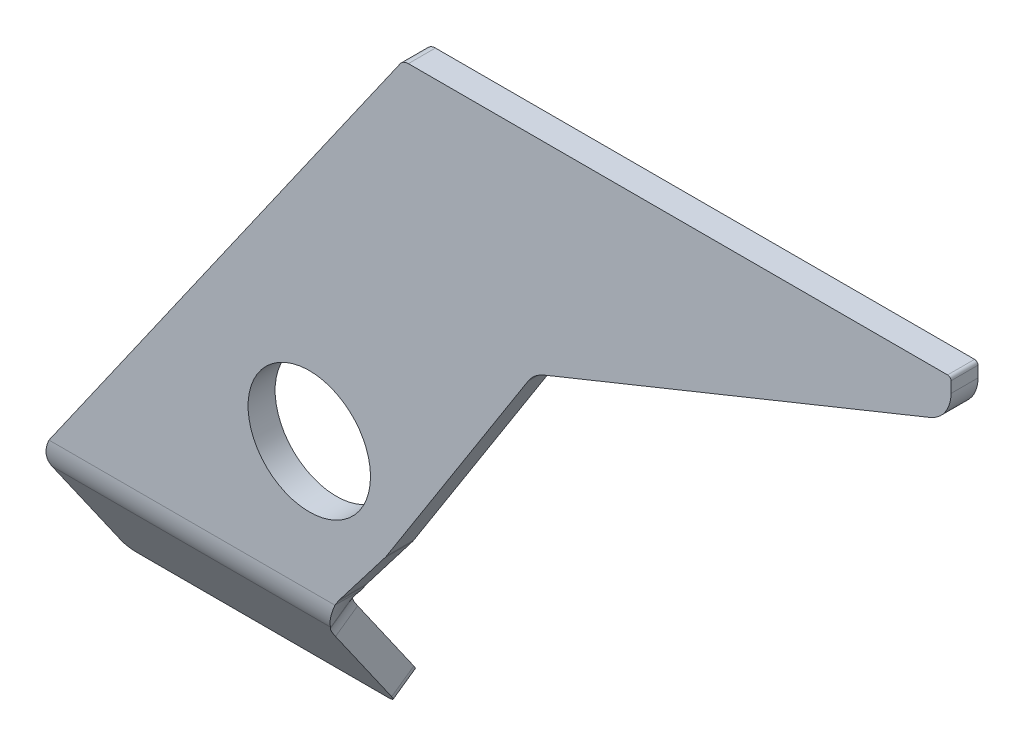
ISO-10303-21;
HEADER;
FILE_DESCRIPTION(('STEP AP214'),'2;1');
FILE_NAME('part.step','',(''),(''),'','','');
FILE_SCHEMA(('AUTOMOTIVE_DESIGN { 1 0 10303 214 1 1 1 1 }'));
ENDSEC;
DATA;
#1=APPLICATION_CONTEXT('core data for automotive mechanical design processes');
#2=APPLICATION_PROTOCOL_DEFINITION('international standard','automotive_design',2000,#1);
#3=PRODUCT_CONTEXT('',#1,'mechanical');
#4=PRODUCT('Part','Part','',(#3));
#5=PRODUCT_RELATED_PRODUCT_CATEGORY('part','',(#4));
#6=PRODUCT_DEFINITION_FORMATION('','',#4);
#7=PRODUCT_DEFINITION_CONTEXT('part definition',#1,'design');
#8=PRODUCT_DEFINITION('design','',#6,#7);
#9=PRODUCT_DEFINITION_SHAPE('','',#8);
#10=(LENGTH_UNIT() NAMED_UNIT(*) SI_UNIT(.MILLI.,.METRE.));
#11=(NAMED_UNIT(*) PLANE_ANGLE_UNIT() SI_UNIT($,.RADIAN.));
#12=(NAMED_UNIT(*) SI_UNIT($,.STERADIAN.) SOLID_ANGLE_UNIT());
#13=UNCERTAINTY_MEASURE_WITH_UNIT(LENGTH_MEASURE(1.E-05),#10,'distance_accuracy_value','');
#14=(GEOMETRIC_REPRESENTATION_CONTEXT(3) GLOBAL_UNCERTAINTY_ASSIGNED_CONTEXT((#13)) GLOBAL_UNIT_ASSIGNED_CONTEXT((#10,
#11,#12)) REPRESENTATION_CONTEXT('',''));
#15=CARTESIAN_POINT('',(0.,0.,0.));
#16=DIRECTION('',(0.,0.,1.));
#17=DIRECTION('',(1.,0.,0.));
#18=AXIS2_PLACEMENT_3D('',#15,#16,#17);
#19=CARTESIAN_POINT('',(-189.,-164.449110298945,1.234970688372));
#20=DIRECTION('',(-1.,0.,0.));
#21=DIRECTION('',(0.,-0.573576436351047,0.819152044288991));
#22=AXIS2_PLACEMENT_3D('',#19,#20,#21);
#23=PLANE('',#22);
#24=DIRECTION('',(0.,0.819152044288991,0.573576436351047));
#25=VECTOR('',#24,1.);
#26=CARTESIAN_POINT('',(-189.,-159.860498808137,-5.31824566593993));
#27=LINE('',#26,#25);
#28=CARTESIAN_POINT('',(-189.,-183.610320243859,-21.9480496663669));
#29=VERTEX_POINT('',#28);
#30=CARTESIAN_POINT('',(-189.,-159.860498808137,-5.31824566593993));
#31=VERTEX_POINT('',#30);
#32=EDGE_CURVE('E97',#29,#31,#27,.T.);
#33=ORIENTED_EDGE('',*,*,#32,.T.);
#34=DIRECTION('',(0.,0.573576436351047,-0.819152044288991));
#35=VECTOR('',#34,1.);
#36=CARTESIAN_POINT('',(-189.,-164.449110298945,1.234970688372));
#37=LINE('',#36,#35);
#38=CARTESIAN_POINT('',(-189.,-164.449110298945,1.234970688372));
#39=VERTEX_POINT('',#38);
#40=EDGE_CURVE('E284',#39,#31,#37,.T.);
#41=ORIENTED_EDGE('',*,*,#40,.F.);
#42=DIRECTION('',(0.,0.819152044288991,0.573576436351047));
#43=VECTOR('',#42,1.);
#44=CARTESIAN_POINT('',(-189.,-164.449110298945,1.234970688372));
#45=LINE('',#44,#43);
#46=CARTESIAN_POINT('',(-189.,-188.198931734667,-15.394833312055));
#47=VERTEX_POINT('',#46);
#48=EDGE_CURVE('E294',#47,#39,#45,.T.);
#49=ORIENTED_EDGE('',*,*,#48,.F.);
#50=DIRECTION('',(0.,0.573576436351047,-0.819152044288991));
#51=VECTOR('',#50,1.);
#52=CARTESIAN_POINT('',(-189.,-188.198931734667,-15.394833312055));
#53=LINE('',#52,#51);
#54=EDGE_CURVE('E264',#47,#29,#53,.T.);
#55=ORIENTED_EDGE('',*,*,#54,.T.);
#56=EDGE_LOOP('',(#33,#41,#49,#55));
#57=FACE_BOUND('',#56,.T.);
#58=ADVANCED_FACE('F39',(#57),#23,.F.);
#59=CARTESIAN_POINT('',(-192.,-188.198931734667,-15.394833312055));
#60=DIRECTION('',(0.,0.573576436351047,-0.819152044288991));
#61=DIRECTION('',(-1.,0.,0.));
#62=AXIS2_PLACEMENT_3D('',#59,#60,#61);
#63=CYLINDRICAL_SURFACE('',#62,3.00000000000002);
#64=CARTESIAN_POINT('',(-192.,-183.610320243859,-21.9480496663669));
#65=DIRECTION('',(0.,-0.573576436351047,0.819152044288991));
#66=DIRECTION('',(-1.,0.,0.));
#67=AXIS2_PLACEMENT_3D('',#64,#65,#66);
#68=CIRCLE('',#67,3.00000000000002);
#69=CARTESIAN_POINT('',(-192.,-186.067776376726,-23.6687789754201));
#70=VERTEX_POINT('',#69);
#71=EDGE_CURVE('E266',#70,#29,#68,.T.);
#72=ORIENTED_EDGE('',*,*,#71,.T.);
#73=ORIENTED_EDGE('',*,*,#54,.F.);
#74=CARTESIAN_POINT('',(-192.,-188.198931734667,-15.394833312055));
#75=DIRECTION('',(0.,-0.573576436351047,0.819152044288991));
#76=DIRECTION('',(-1.,0.,0.));
#77=AXIS2_PLACEMENT_3D('',#74,#75,#76);
#78=CIRCLE('',#77,3.00000000000002);
#79=CARTESIAN_POINT('',(-192.,-190.656387867534,-17.1155626211081));
#80=VERTEX_POINT('',#79);
#81=EDGE_CURVE('E292',#80,#47,#78,.T.);
#82=ORIENTED_EDGE('',*,*,#81,.F.);
#83=DIRECTION('',(0.,0.573576436351047,-0.819152044288991));
#84=VECTOR('',#83,1.);
#85=CARTESIAN_POINT('',(-192.,-190.656387867534,-17.1155626211081));
#86=LINE('',#85,#84);
#87=EDGE_CURVE('E268',#80,#70,#86,.T.);
#88=ORIENTED_EDGE('',*,*,#87,.T.);
#89=EDGE_LOOP('',(#72,#73,#82,#88));
#90=FACE_BOUND('',#89,.T.);
#91=ADVANCED_FACE('F647',(#90),#63,.T.);
#92=CARTESIAN_POINT('',(-192.,-190.656387867534,-17.1155626211081));
#93=DIRECTION('',(0.,0.819152044288991,0.573576436351047));
#94=DIRECTION('',(-1.,0.,0.));
#95=AXIS2_PLACEMENT_3D('',#92,#93,#94);
#96=PLANE('',#95);
#97=DIRECTION('',(1.,0.,0.));
#98=VECTOR('',#97,1.);
#99=CARTESIAN_POINT('',(-192.,-186.067776376726,-23.6687789754201));
#100=LINE('',#99,#98);
#101=CARTESIAN_POINT('',(-266.,-186.067776376726,-23.6687789754201));
#102=VERTEX_POINT('',#101);
#103=EDGE_CURVE('E271',#102,#70,#100,.T.);
#104=ORIENTED_EDGE('',*,*,#103,.T.);
#105=ORIENTED_EDGE('',*,*,#87,.F.);
#106=DIRECTION('',(1.,0.,0.));
#107=VECTOR('',#106,1.);
#108=CARTESIAN_POINT('',(-192.,-190.656387867534,-17.1155626211081));
#109=LINE('',#108,#107);
#110=CARTESIAN_POINT('',(-266.,-190.656387867534,-17.1155626211081));
#111=VERTEX_POINT('',#110);
#112=EDGE_CURVE('E290',#111,#80,#109,.T.);
#113=ORIENTED_EDGE('',*,*,#112,.F.);
#114=DIRECTION('',(0.,0.573576436351047,-0.819152044288991));
#115=VECTOR('',#114,1.);
#116=CARTESIAN_POINT('',(-266.,-190.656387867534,-17.1155626211081));
#117=LINE('',#116,#115);
#118=EDGE_CURVE('E273',#111,#102,#117,.T.);
#119=ORIENTED_EDGE('',*,*,#118,.T.);
#120=EDGE_LOOP('',(#104,#105,#113,#119));
#121=FACE_BOUND('',#120,.T.);
#122=ADVANCED_FACE('F652',(#121),#96,.F.);
#123=CARTESIAN_POINT('',(-266.,-188.198931734667,-15.394833312055));
#124=DIRECTION('',(0.,0.573576436351047,-0.819152044288991));
#125=DIRECTION('',(-1.,0.,0.));
#126=AXIS2_PLACEMENT_3D('',#123,#124,#125);
#127=CYLINDRICAL_SURFACE('',#126,2.99999999999999);
#128=CARTESIAN_POINT('',(-266.,-183.610320243859,-21.9480496663669));
#129=DIRECTION('',(0.,-0.573576436351047,0.819152044288991));
#130=DIRECTION('',(-1.,0.,0.));
#131=AXIS2_PLACEMENT_3D('',#128,#129,#130);
#132=CIRCLE('',#131,2.99999999999999);
#133=CARTESIAN_POINT('',(-269.,-183.610320243859,-21.9480496663669));
#134=VERTEX_POINT('',#133);
#135=EDGE_CURVE('E276',#134,#102,#132,.T.);
#136=ORIENTED_EDGE('',*,*,#135,.T.);
#137=ORIENTED_EDGE('',*,*,#118,.F.);
#138=CARTESIAN_POINT('',(-266.,-188.198931734667,-15.394833312055));
#139=DIRECTION('',(0.,-0.573576436351047,0.819152044288991));
#140=DIRECTION('',(-1.,0.,0.));
#141=AXIS2_PLACEMENT_3D('',#138,#139,#140);
#142=CIRCLE('',#141,2.99999999999999);
#143=CARTESIAN_POINT('',(-269.,-188.198931734667,-15.394833312055));
#144=VERTEX_POINT('',#143);
#145=EDGE_CURVE('E288',#144,#111,#142,.T.);
#146=ORIENTED_EDGE('',*,*,#145,.F.);
#147=DIRECTION('',(0.,0.573576436351047,-0.819152044288991));
#148=VECTOR('',#147,1.);
#149=CARTESIAN_POINT('',(-269.,-188.198931734667,-15.394833312055));
#150=LINE('',#149,#148);
#151=EDGE_CURVE('E278',#144,#134,#150,.T.);
#152=ORIENTED_EDGE('',*,*,#151,.T.);
#153=EDGE_LOOP('',(#136,#137,#146,#152));
#154=FACE_BOUND('',#153,.T.);
#155=ADVANCED_FACE('F657',(#154),#127,.T.);
#156=CARTESIAN_POINT('',(-179.,-164.449110298945,1.234970688372));
#157=DIRECTION('',(0.,0.573576436351047,-0.819152044288991));
#158=DIRECTION('',(-1.,0.,0.));
#159=AXIS2_PLACEMENT_3D('',#156,#157,#158);
#160=CYLINDRICAL_SURFACE('',#159,10.);
#161=CARTESIAN_POINT('',(-179.,-159.860498808137,-5.31824566593993));
#162=DIRECTION('',(0.,0.573576436351047,-0.819152044288991));
#163=DIRECTION('',(1.,0.,0.));
#164=AXIS2_PLACEMENT_3D('',#161,#162,#163);
#165=CIRCLE('',#164,10.);
#166=CARTESIAN_POINT('',(-187.433914458129,-155.459198082407,-2.23642171985605));
#167=VERTEX_POINT('',#166);
#168=EDGE_CURVE('E281',#31,#167,#165,.T.);
#169=ORIENTED_EDGE('',*,*,#168,.T.);
#170=DIRECTION('',(0.,0.573576436351047,-0.819152044288991));
#171=VECTOR('',#170,1.);
#172=CARTESIAN_POINT('',(-187.433914458129,-160.047809573216,4.31679463445588));
#173=LINE('',#172,#171);
#174=CARTESIAN_POINT('',(-187.433914458129,-160.047809573216,4.31679463445588));
#175=VERTEX_POINT('',#174);
#176=EDGE_CURVE('E256',#175,#167,#173,.T.);
#177=ORIENTED_EDGE('',*,*,#176,.F.);
#178=CARTESIAN_POINT('',(-179.,-164.449110298945,1.234970688372));
#179=DIRECTION('',(0.,0.573576436351047,-0.819152044288991));
#180=DIRECTION('',(1.,0.,0.));
#181=AXIS2_PLACEMENT_3D('',#178,#179,#180);
#182=CIRCLE('',#181,10.);
#183=EDGE_CURVE('E49',#39,#175,#182,.T.);
#184=ORIENTED_EDGE('',*,*,#183,.F.);
#185=ORIENTED_EDGE('',*,*,#40,.T.);
#186=EDGE_LOOP('',(#169,#177,#184,#185));
#187=FACE_BOUND('',#186,.T.);
#188=ADVANCED_FACE('F636',(#187),#160,.F.);
#189=CARTESIAN_POINT('',(-181.531080860369,-152.457880320241,9.63132031186721));
#190=DIRECTION('',(-0.843391445812885,0.440130072572976,0.308182394608385));
#191=DIRECTION('',(-0.537299608346825,-0.690865826973473,-0.483749459938312));
#192=AXIS2_PLACEMENT_3D('',#189,#190,#191);
#193=PLANE('',#192);
#194=CARTESIAN_POINT('',(-186.55686494568,-158.920089531545,5.10643270862383));
#195=CARTESIAN_POINT('',(-186.55686494568,-154.331478040737,-1.44678364568809));
#196=B_SPLINE_CURVE_WITH_KNOTS('',1,(#194,#195),.UNSPECIFIED.,.F.,.F.,(2,2),(0.,1.),.UNSPECIFIED.);
#197=CARTESIAN_POINT('',(-186.55686494568,-158.920089531545,5.10643270862384));
#198=VERTEX_POINT('',#197);
#199=CARTESIAN_POINT('',(-186.55686494568,-154.331478040737,-1.44678364568809));
#200=VERTEX_POINT('',#199);
#201=EDGE_CURVE('E237',#198,#200,#196,.T.);
#202=ORIENTED_EDGE('',*,*,#201,.F.);
#203=DIRECTION('',(0.537299608346825,0.690865826973473,0.483749459938312));
#204=VECTOR('',#203,1.);
#205=CARTESIAN_POINT('',(-181.531080860369,-152.457880320241,9.63132031186721));
#206=LINE('',#205,#204);
#207=EDGE_CURVE('E230',#175,#198,#206,.T.);
#208=ORIENTED_EDGE('',*,*,#207,.F.);
#209=ORIENTED_EDGE('',*,*,#176,.T.);
#210=DIRECTION('',(0.537299608346825,0.690865826973473,0.483749459938312));
#211=VECTOR('',#210,1.);
#212=CARTESIAN_POINT('',(-181.531080860369,-147.869268829433,3.07810395755528));
#213=LINE('',#212,#211);
#214=EDGE_CURVE('E58',#167,#200,#213,.T.);
#215=ORIENTED_EDGE('',*,*,#214,.T.);
#216=EDGE_LOOP('',(#202,#208,#209,#215));
#217=FACE_BOUND('',#216,.T.);
#218=ADVANCED_FACE('F246',(#217),#193,.F.);
#219=CARTESIAN_POINT('',(-179.,-164.449110298945,1.234970688372));
#220=DIRECTION('',(0.,-0.573576436351047,0.819152044288991));
#221=DIRECTION('',(1.,0.,0.));
#222=AXIS2_PLACEMENT_3D('',#219,#220,#221);
#223=PLANE('',#222);
#224=ORIENTED_EDGE('',*,*,#207,.T.);
#225=DIRECTION('',(-1.,0.,0.));
#226=VECTOR('',#225,1.);
#227=CARTESIAN_POINT('',(-179.,-158.920089531545,5.10643270862386));
#228=LINE('',#227,#226);
#229=CARTESIAN_POINT('',(-269.,-158.920089531545,5.10643270862386));
#230=VERTEX_POINT('',#229);
#231=EDGE_CURVE('E220',#198,#230,#228,.T.);
#232=ORIENTED_EDGE('',*,*,#231,.T.);
#233=DIRECTION('',(0.,-0.819152044288991,-0.573576436351047));
#234=VECTOR('',#233,1.);
#235=CARTESIAN_POINT('',(-269.,-188.198931734667,-15.394833312055));
#236=LINE('',#235,#234);
#237=EDGE_CURVE('E229',#230,#144,#236,.T.);
#238=ORIENTED_EDGE('',*,*,#237,.T.);
#239=ORIENTED_EDGE('',*,*,#145,.T.);
#240=ORIENTED_EDGE('',*,*,#112,.T.);
#241=ORIENTED_EDGE('',*,*,#81,.T.);
#242=ORIENTED_EDGE('',*,*,#48,.T.);
#243=ORIENTED_EDGE('',*,*,#183,.T.);
#244=EDGE_LOOP('',(#224,#232,#238,#239,#240,#241,#242,#243));
#245=FACE_BOUND('',#244,.T.);
#246=ADVANCED_FACE('F252',(#245),#223,.T.);
#247=CARTESIAN_POINT('',(-269.,-188.198931734667,-15.394833312055));
#248=DIRECTION('',(1.,0.,0.));
#249=DIRECTION('',(0.,0.819152044288991,0.573576436351047));
#250=AXIS2_PLACEMENT_3D('',#247,#248,#249);
#251=PLANE('',#250);
#252=DIRECTION('',(0.,-0.573576436351047,0.819152044288991));
#253=VECTOR('',#252,1.);
#254=CARTESIAN_POINT('',(-269.,-158.920089531545,5.10643270862386));
#255=LINE('',#254,#253);
#256=CARTESIAN_POINT('',(-269.,-154.331478040737,-1.44678364568808));
#257=VERTEX_POINT('',#256);
#258=EDGE_CURVE('E261',#257,#230,#255,.T.);
#259=ORIENTED_EDGE('',*,*,#258,.F.);
#260=DIRECTION('',(0.,-0.819152044288991,-0.573576436351047));
#261=VECTOR('',#260,1.);
#262=CARTESIAN_POINT('',(-269.,-183.610320243859,-21.9480496663669));
#263=LINE('',#262,#261);
#264=EDGE_CURVE('E11',#257,#134,#263,.T.);
#265=ORIENTED_EDGE('',*,*,#264,.T.);
#266=ORIENTED_EDGE('',*,*,#151,.F.);
#267=ORIENTED_EDGE('',*,*,#237,.F.);
#268=EDGE_LOOP('',(#259,#265,#266,#267));
#269=FACE_BOUND('',#268,.T.);
#270=ADVANCED_FACE('F639',(#269),#251,.F.);
#271=CARTESIAN_POINT('',(-179.,-159.860498808137,-5.31824566593993));
#272=DIRECTION('',(0.,-0.573576436351047,0.819152044288991));
#273=DIRECTION('',(1.,0.,0.));
#274=AXIS2_PLACEMENT_3D('',#271,#272,#273);
#275=PLANE('',#274);
#276=DIRECTION('',(-1.,0.,0.));
#277=VECTOR('',#276,1.);
#278=CARTESIAN_POINT('',(-179.,-154.331478040737,-1.44678364568807));
#279=LINE('',#278,#277);
#280=EDGE_CURVE('E248',#200,#257,#279,.T.);
#281=ORIENTED_EDGE('',*,*,#280,.F.);
#282=ORIENTED_EDGE('',*,*,#214,.F.);
#283=ORIENTED_EDGE('',*,*,#168,.F.);
#284=ORIENTED_EDGE('',*,*,#32,.F.);
#285=ORIENTED_EDGE('',*,*,#71,.F.);
#286=ORIENTED_EDGE('',*,*,#103,.F.);
#287=ORIENTED_EDGE('',*,*,#135,.F.);
#288=ORIENTED_EDGE('',*,*,#264,.F.);
#289=EDGE_LOOP('',(#281,#282,#283,#284,#285,#286,#287,#288));
#290=FACE_BOUND('',#289,.T.);
#291=ADVANCED_FACE('F41',(#290),#275,.F.);
#292=CARTESIAN_POINT('',(-267.19152044289,-149.917223525279,8.));
#293=DIRECTION('',(0.819152044288994,-0.573576436351042,0.));
#294=DIRECTION('',(0.573576436351042,0.819152044288994,0.));
#295=AXIS2_PLACEMENT_3D('',#292,#293,#294);
#296=PLANE('',#295);
#297=DIRECTION('',(-0.573576436351043,-0.819152044288994,0.));
#298=VECTOR('',#297,1.);
#299=CARTESIAN_POINT('',(-267.19152044289,-149.917223525279,0.));
#300=LINE('',#299,#298);
#301=CARTESIAN_POINT('',(-163.114105404232,-1.27927069094687,0.));
#302=VERTEX_POINT('',#301);
#303=CARTESIAN_POINT('',(-267.06943437441,-149.742866549928,0.));
#304=VERTEX_POINT('',#303);
#305=EDGE_CURVE('E387',#302,#304,#300,.T.);
#306=ORIENTED_EDGE('',*,*,#305,.T.);
#307=CARTESIAN_POINT('',(-267.06943437441,-149.742866549928,7.99999999999999));
#308=CARTESIAN_POINT('',(-267.06943437441,-149.742866549928,0.));
#309=B_SPLINE_CURVE_WITH_KNOTS('',1,(#307,#308),.UNSPECIFIED.,.F.,.F.,(2,2),(0.,1.),.UNSPECIFIED.);
#310=CARTESIAN_POINT('',(-267.069434374409,-149.742866549928,7.99999999999999));
#311=VERTEX_POINT('',#310);
#312=EDGE_CURVE('E249',#304,#311,#309,.F.);
#313=ORIENTED_EDGE('',*,*,#312,.T.);
#314=DIRECTION('',(-0.573576436351043,-0.819152044288994,0.));
#315=VECTOR('',#314,1.);
#316=CARTESIAN_POINT('',(-267.19152044289,-149.917223525279,8.));
#317=LINE('',#316,#315);
#318=CARTESIAN_POINT('',(-163.114105404232,-1.27927069094687,8.));
#319=VERTEX_POINT('',#318);
#320=EDGE_CURVE('E407',#319,#311,#317,.T.);
#321=ORIENTED_EDGE('',*,*,#320,.F.);
#322=DIRECTION('',(0.,0.,-1.));
#323=VECTOR('',#322,1.);
#324=CARTESIAN_POINT('',(-163.114105404232,-1.27927069094687,8.));
#325=LINE('',#324,#323);
#326=EDGE_CURVE('E404',#319,#302,#325,.T.);
#327=ORIENTED_EDGE('',*,*,#326,.T.);
#328=EDGE_LOOP('',(#306,#313,#321,#327));
#329=FACE_BOUND('',#328,.T.);
#330=ADVANCED_FACE('F303',(#329),#296,.F.);
#331=CARTESIAN_POINT('',(-179.,-163.006821503649,0.));
#332=DIRECTION('',(0.,0.,1.));
#333=DIRECTION('',(1.,0.,0.));
#334=AXIS2_PLACEMENT_3D('',#331,#332,#333);
#335=PLANE('',#334);
#336=CARTESIAN_POINT('',(-190.,-111.5,0.));
#337=DIRECTION('',(0.,0.,1.));
#338=DIRECTION('',(1.,0.,0.));
#339=AXIS2_PLACEMENT_3D('',#336,#337,#338);
#340=CIRCLE('',#339,18.1250000000005);
#341=CARTESIAN_POINT('',(-171.874999999999,-111.5,0.));
#342=VERTEX_POINT('',#341);
#343=EDGE_CURVE('E576',#342,#342,#340,.T.);
#344=ORIENTED_EDGE('',*,*,#343,.T.);
#345=EDGE_LOOP('',(#344));
#346=FACE_BOUND('',#345,.T.);
#347=DIRECTION('',(0.537299608346825,0.843391445812885,0.));
#348=VECTOR('',#347,1.);
#349=CARTESIAN_POINT('',(-181.531080860369,-148.368232657652,0.));
#350=LINE('',#349,#348);
#351=CARTESIAN_POINT('',(-182.406819232636,-149.742866549928,0.));
#352=VERTEX_POINT('',#351);
#353=CARTESIAN_POINT('',(-181.531080860369,-148.368232657652,0.));
#354=VERTEX_POINT('',#353);
#355=EDGE_CURVE('E381',#352,#354,#350,.T.);
#356=ORIENTED_EDGE('',*,*,#355,.F.);
#357=DIRECTION('',(-1.,0.,0.));
#358=VECTOR('',#357,1.);
#359=CARTESIAN_POINT('',(-179.,-149.742866549928,0.));
#360=LINE('',#359,#358);
#361=EDGE_CURVE('E112',#352,#304,#360,.T.);
#362=ORIENTED_EDGE('',*,*,#361,.T.);
#363=ORIENTED_EDGE('',*,*,#305,.F.);
#364=CARTESIAN_POINT('',(-160.656649271365,-3.,0.));
#365=DIRECTION('',(0.,0.,1.));
#366=DIRECTION('',(-1.,0.,0.));
#367=AXIS2_PLACEMENT_3D('',#364,#365,#366);
#368=CIRCLE('',#367,2.99999999999999);
#369=CARTESIAN_POINT('',(-160.656649271365,0.,0.));
#370=VERTEX_POINT('',#369);
#371=EDGE_CURVE('E389',#370,#302,#368,.T.);
#372=ORIENTED_EDGE('',*,*,#371,.F.);
#373=DIRECTION('',(-1.,0.,0.));
#374=VECTOR('',#373,1.);
#375=CARTESIAN_POINT('',(-160.656649271365,0.,0.));
#376=LINE('',#375,#374);
#377=CARTESIAN_POINT('',(-1.00000000000001,0.,0.));
#378=VERTEX_POINT('',#377);
#379=EDGE_CURVE('E395',#378,#370,#376,.T.);
#380=ORIENTED_EDGE('',*,*,#379,.F.);
#381=CARTESIAN_POINT('',(-1.,-1.,0.));
#382=DIRECTION('',(0.,0.,1.));
#383=DIRECTION('',(1.,0.,0.));
#384=AXIS2_PLACEMENT_3D('',#381,#382,#383);
#385=CIRCLE('',#384,1.);
#386=CARTESIAN_POINT('',(0.,-1.00000000000001,0.));
#387=VERTEX_POINT('',#386);
#388=EDGE_CURVE('E400',#387,#378,#385,.T.);
#389=ORIENTED_EDGE('',*,*,#388,.F.);
#390=DIRECTION('',(0.,1.,0.));
#391=VECTOR('',#390,1.);
#392=CARTESIAN_POINT('',(0.,-1.00000000000001,0.));
#393=LINE('',#392,#391);
#394=CARTESIAN_POINT('',(0.,-4.26011580755495,0.));
#395=VERTEX_POINT('',#394);
#396=EDGE_CURVE('E845',#395,#387,#393,.T.);
#397=ORIENTED_EDGE('',*,*,#396,.F.);
#398=CARTESIAN_POINT('',(-10.,-4.26011580755496,0.));
#399=DIRECTION('',(0.,0.,1.));
#400=DIRECTION('',(-1.,0.,0.));
#401=AXIS2_PLACEMENT_3D('',#398,#399,#400);
#402=CIRCLE('',#401,10.);
#403=CARTESIAN_POINT('',(-6.24730471414338,-13.5292731636208,0.));
#404=VERTEX_POINT('',#403);
#405=EDGE_CURVE('E843',#404,#395,#402,.T.);
#406=ORIENTED_EDGE('',*,*,#405,.F.);
#407=DIRECTION('',(0.926915735606584,0.375269528585662,0.));
#408=VECTOR('',#407,1.);
#409=CARTESIAN_POINT('',(-6.24730471414338,-13.5292731636208,0.));
#410=LINE('',#409,#408);
#411=CARTESIAN_POINT('',(-120.53657270734,-59.80023186532,0.));
#412=VERTEX_POINT('',#411);
#413=EDGE_CURVE('E841',#412,#404,#410,.T.);
#414=ORIENTED_EDGE('',*,*,#413,.F.);
#415=CARTESIAN_POINT('',(-116.783877421484,-69.0693892213859,0.));
#416=DIRECTION('',(0.,0.,-1.));
#417=DIRECTION('',(1.,0.,0.));
#418=AXIS2_PLACEMENT_3D('',#415,#416,#417);
#419=CIRCLE('',#418,10.);
#420=CARTESIAN_POINT('',(-125.217791879613,-63.6963931379176,0.));
#421=VERTEX_POINT('',#420);
#422=EDGE_CURVE('E839',#421,#412,#419,.T.);
#423=ORIENTED_EDGE('',*,*,#422,.F.);
#424=DIRECTION('',(0.537299608346826,0.843391445812884,0.));
#425=VECTOR('',#424,1.);
#426=CARTESIAN_POINT('',(-125.217791879613,-63.6963931379176,0.));
#427=LINE('',#426,#425);
#428=CARTESIAN_POINT('',(-167.092392566934,-129.42634988436,0.));
#429=VERTEX_POINT('',#428);
#430=EDGE_CURVE('E837',#429,#421,#427,.T.);
#431=ORIENTED_EDGE('',*,*,#430,.F.);
#432=CARTESIAN_POINT('',(-175.526307025063,-124.053353800892,0.));
#433=DIRECTION('',(0.,0.,1.));
#434=DIRECTION('',(1.,0.,0.));
#435=AXIS2_PLACEMENT_3D('',#432,#433,#434);
#436=CIRCLE('',#435,10.);
#437=CARTESIAN_POINT('',(-167.592773622151,-130.140968090979,0.));
#438=VERTEX_POINT('',#437);
#439=EDGE_CURVE('E835',#438,#429,#436,.T.);
#440=ORIENTED_EDGE('',*,*,#439,.F.);
#441=DIRECTION('',(0.608761429008737,0.793353340291223,0.));
#442=VECTOR('',#441,1.);
#443=CARTESIAN_POINT('',(-167.592773622151,-130.140968090979,0.));
#444=LINE('',#443,#442);
#445=CARTESIAN_POINT('',(-181.030699805152,-147.653614451033,0.));
#446=VERTEX_POINT('',#445);
#447=EDGE_CURVE('E833',#446,#438,#444,.T.);
#448=ORIENTED_EDGE('',*,*,#447,.F.);
#449=CARTESIAN_POINT('',(-173.09716640224,-153.74122874112,0.));
#450=DIRECTION('',(0.,0.,-1.));
#451=DIRECTION('',(1.,0.,0.));
#452=AXIS2_PLACEMENT_3D('',#449,#450,#451);
#453=CIRCLE('',#452,10.);
#454=EDGE_CURVE('E383',#354,#446,#453,.T.);
#455=ORIENTED_EDGE('',*,*,#454,.F.);
#456=EDGE_LOOP('',(#356,#362,#363,#372,#380,#389,#397,#406,#414,#423,#431,#440,#448,#455));
#457=FACE_BOUND('',#456,.T.);
#458=ADVANCED_FACE('F313',(#346,#457),#335,.F.);
#459=CARTESIAN_POINT('',(-181.531080860369,-148.368232657652,8.));
#460=DIRECTION('',(-0.843391445812885,0.537299608346825,0.));
#461=DIRECTION('',(-0.537299608346825,-0.843391445812885,0.));
#462=AXIS2_PLACEMENT_3D('',#459,#460,#461);
#463=PLANE('',#462);
#464=DIRECTION('',(0.537299608346825,0.843391445812885,0.));
#465=VECTOR('',#464,1.);
#466=CARTESIAN_POINT('',(-181.531080860369,-148.368232657652,8.));
#467=LINE('',#466,#465);
#468=CARTESIAN_POINT('',(-182.406819232636,-149.742866549928,8.));
#469=VERTEX_POINT('',#468);
#470=CARTESIAN_POINT('',(-181.531080860369,-148.368232657652,8.));
#471=VERTEX_POINT('',#470);
#472=EDGE_CURVE('E388',#469,#471,#467,.T.);
#473=ORIENTED_EDGE('',*,*,#472,.F.);
#474=CARTESIAN_POINT('',(-182.406819232636,-149.742866549928,0.));
#475=CARTESIAN_POINT('',(-182.406819232636,-149.742866549928,7.99999999999999));
#476=B_SPLINE_CURVE_WITH_KNOTS('',1,(#474,#475),.UNSPECIFIED.,.F.,.F.,(2,2),(0.,1.),.UNSPECIFIED.);
#477=EDGE_CURVE('E120',#469,#352,#476,.F.);
#478=ORIENTED_EDGE('',*,*,#477,.T.);
#479=ORIENTED_EDGE('',*,*,#355,.T.);
#480=DIRECTION('',(0.,0.,-1.));
#481=VECTOR('',#480,1.);
#482=CARTESIAN_POINT('',(-181.531080860369,-148.368232657652,8.));
#483=LINE('',#482,#481);
#484=EDGE_CURVE('E436',#471,#354,#483,.T.);
#485=ORIENTED_EDGE('',*,*,#484,.F.);
#486=EDGE_LOOP('',(#473,#478,#479,#485));
#487=FACE_BOUND('',#486,.T.);
#488=ADVANCED_FACE('F362',(#487),#463,.F.);
#489=CARTESIAN_POINT('',(-179.,-163.006821503649,8.));
#490=DIRECTION('',(0.,0.,1.));
#491=DIRECTION('',(1.,0.,0.));
#492=AXIS2_PLACEMENT_3D('',#489,#490,#491);
#493=PLANE('',#492);
#494=DIRECTION('',(-1.,0.,0.));
#495=VECTOR('',#494,1.);
#496=CARTESIAN_POINT('',(-179.,-149.742866549928,8.));
#497=LINE('',#496,#495);
#498=EDGE_CURVE('E378',#469,#311,#497,.T.);
#499=ORIENTED_EDGE('',*,*,#498,.F.);
#500=ORIENTED_EDGE('',*,*,#472,.T.);
#501=CARTESIAN_POINT('',(-173.09716640224,-153.74122874112,8.));
#502=DIRECTION('',(0.,0.,-1.));
#503=DIRECTION('',(1.,0.,0.));
#504=AXIS2_PLACEMENT_3D('',#501,#502,#503);
#505=CIRCLE('',#504,10.);
#506=CARTESIAN_POINT('',(-181.030699805152,-147.653614451033,8.));
#507=VERTEX_POINT('',#506);
#508=EDGE_CURVE('E393',#471,#507,#505,.T.);
#509=ORIENTED_EDGE('',*,*,#508,.T.);
#510=DIRECTION('',(0.608761429008737,0.793353340291223,0.));
#511=VECTOR('',#510,1.);
#512=CARTESIAN_POINT('',(-167.592773622151,-130.140968090979,8.));
#513=LINE('',#512,#511);
#514=CARTESIAN_POINT('',(-167.592773622151,-130.140968090979,8.));
#515=VERTEX_POINT('',#514);
#516=EDGE_CURVE('E810',#507,#515,#513,.T.);
#517=ORIENTED_EDGE('',*,*,#516,.T.);
#518=CARTESIAN_POINT('',(-175.526307025063,-124.053353800892,8.));
#519=DIRECTION('',(0.,0.,1.));
#520=DIRECTION('',(1.,0.,0.));
#521=AXIS2_PLACEMENT_3D('',#518,#519,#520);
#522=CIRCLE('',#521,10.);
#523=CARTESIAN_POINT('',(-167.092392566934,-129.42634988436,8.));
#524=VERTEX_POINT('',#523);
#525=EDGE_CURVE('E812',#515,#524,#522,.T.);
#526=ORIENTED_EDGE('',*,*,#525,.T.);
#527=DIRECTION('',(0.537299608346826,0.843391445812884,0.));
#528=VECTOR('',#527,1.);
#529=CARTESIAN_POINT('',(-125.217791879613,-63.6963931379176,8.));
#530=LINE('',#529,#528);
#531=CARTESIAN_POINT('',(-125.217791879613,-63.6963931379176,8.));
#532=VERTEX_POINT('',#531);
#533=EDGE_CURVE('E817',#524,#532,#530,.T.);
#534=ORIENTED_EDGE('',*,*,#533,.T.);
#535=CARTESIAN_POINT('',(-116.783877421484,-69.0693892213859,8.));
#536=DIRECTION('',(0.,0.,-1.));
#537=DIRECTION('',(1.,0.,0.));
#538=AXIS2_PLACEMENT_3D('',#535,#536,#537);
#539=CIRCLE('',#538,10.);
#540=CARTESIAN_POINT('',(-120.53657270734,-59.80023186532,8.));
#541=VERTEX_POINT('',#540);
#542=EDGE_CURVE('E819',#532,#541,#539,.T.);
#543=ORIENTED_EDGE('',*,*,#542,.T.);
#544=DIRECTION('',(0.926915735606584,0.375269528585662,0.));
#545=VECTOR('',#544,1.);
#546=CARTESIAN_POINT('',(-6.24730471414338,-13.5292731636208,8.));
#547=LINE('',#546,#545);
#548=CARTESIAN_POINT('',(-6.24730471414338,-13.5292731636208,8.));
#549=VERTEX_POINT('',#548);
#550=EDGE_CURVE('E821',#541,#549,#547,.T.);
#551=ORIENTED_EDGE('',*,*,#550,.T.);
#552=CARTESIAN_POINT('',(-10.,-4.26011580755496,8.));
#553=DIRECTION('',(0.,0.,1.));
#554=DIRECTION('',(-1.,0.,0.));
#555=AXIS2_PLACEMENT_3D('',#552,#553,#554);
#556=CIRCLE('',#555,10.);
#557=CARTESIAN_POINT('',(0.,-4.26011580755495,8.));
#558=VERTEX_POINT('',#557);
#559=EDGE_CURVE('E823',#549,#558,#556,.T.);
#560=ORIENTED_EDGE('',*,*,#559,.T.);
#561=DIRECTION('',(0.,1.,0.));
#562=VECTOR('',#561,1.);
#563=CARTESIAN_POINT('',(0.,-1.00000000000001,8.));
#564=LINE('',#563,#562);
#565=CARTESIAN_POINT('',(0.,-1.00000000000001,8.));
#566=VERTEX_POINT('',#565);
#567=EDGE_CURVE('E825',#558,#566,#564,.T.);
#568=ORIENTED_EDGE('',*,*,#567,.T.);
#569=CARTESIAN_POINT('',(-1.,-1.,8.));
#570=DIRECTION('',(0.,0.,1.));
#571=DIRECTION('',(1.,0.,0.));
#572=AXIS2_PLACEMENT_3D('',#569,#570,#571);
#573=CIRCLE('',#572,1.);
#574=CARTESIAN_POINT('',(-1.00000000000001,0.,8.));
#575=VERTEX_POINT('',#574);
#576=EDGE_CURVE('E827',#566,#575,#573,.T.);
#577=ORIENTED_EDGE('',*,*,#576,.T.);
#578=DIRECTION('',(-1.,0.,0.));
#579=VECTOR('',#578,1.);
#580=CARTESIAN_POINT('',(-160.656649271365,0.,8.));
#581=LINE('',#580,#579);
#582=CARTESIAN_POINT('',(-160.656649271365,0.,8.));
#583=VERTEX_POINT('',#582);
#584=EDGE_CURVE('E829',#575,#583,#581,.T.);
#585=ORIENTED_EDGE('',*,*,#584,.T.);
#586=CARTESIAN_POINT('',(-160.656649271365,-3.,8.));
#587=DIRECTION('',(0.,0.,1.));
#588=DIRECTION('',(-1.,0.,0.));
#589=AXIS2_PLACEMENT_3D('',#586,#587,#588);
#590=CIRCLE('',#589,2.99999999999999);
#591=EDGE_CURVE('E440',#583,#319,#590,.T.);
#592=ORIENTED_EDGE('',*,*,#591,.T.);
#593=ORIENTED_EDGE('',*,*,#320,.T.);
#594=EDGE_LOOP('',(#499,#500,#509,#517,#526,#534,#543,#551,#560,#568,#577,#585,#592,#593));
#595=FACE_BOUND('',#594,.T.);
#596=CARTESIAN_POINT('',(-190.,-111.5,8.));
#597=DIRECTION('',(0.,0.,1.));
#598=DIRECTION('',(1.,0.,0.));
#599=AXIS2_PLACEMENT_3D('',#596,#597,#598);
#600=CIRCLE('',#599,18.1250000000005);
#601=CARTESIAN_POINT('',(-171.874999999999,-111.5,8.));
#602=VERTEX_POINT('',#601);
#603=EDGE_CURVE('E384',#602,#602,#600,.T.);
#604=ORIENTED_EDGE('',*,*,#603,.F.);
#605=EDGE_LOOP('',(#604));
#606=FACE_BOUND('',#605,.T.);
#607=ADVANCED_FACE('F360',(#595,#606),#493,.T.);
#608=CARTESIAN_POINT('',(-173.09716640224,-153.74122874112,8.));
#609=DIRECTION('',(0.,0.,-1.));
#610=DIRECTION('',(-1.,0.,0.));
#611=AXIS2_PLACEMENT_3D('',#608,#609,#610);
#612=CYLINDRICAL_SURFACE('',#611,10.);
#613=ORIENTED_EDGE('',*,*,#454,.T.);
#614=DIRECTION('',(0.,0.,-1.));
#615=VECTOR('',#614,1.);
#616=CARTESIAN_POINT('',(-181.030699805152,-147.653614451033,8.));
#617=LINE('',#616,#615);
#618=EDGE_CURVE('E433',#507,#446,#617,.T.);
#619=ORIENTED_EDGE('',*,*,#618,.F.);
#620=ORIENTED_EDGE('',*,*,#508,.F.);
#621=ORIENTED_EDGE('',*,*,#484,.T.);
#622=EDGE_LOOP('',(#613,#619,#620,#621));
#623=FACE_BOUND('',#622,.T.);
#624=ADVANCED_FACE('F356',(#623),#612,.F.);
#625=CARTESIAN_POINT('',(-167.592773622151,-130.140968090979,8.));
#626=DIRECTION('',(-0.793353340291223,0.608761429008737,0.));
#627=DIRECTION('',(-0.608761429008737,-0.793353340291223,0.));
#628=AXIS2_PLACEMENT_3D('',#625,#626,#627);
#629=PLANE('',#628);
#630=ORIENTED_EDGE('',*,*,#447,.T.);
#631=DIRECTION('',(0.,0.,-1.));
#632=VECTOR('',#631,1.);
#633=CARTESIAN_POINT('',(-167.592773622151,-130.140968090979,8.));
#634=LINE('',#633,#632);
#635=EDGE_CURVE('E430',#515,#438,#634,.T.);
#636=ORIENTED_EDGE('',*,*,#635,.F.);
#637=ORIENTED_EDGE('',*,*,#516,.F.);
#638=ORIENTED_EDGE('',*,*,#618,.T.);
#639=EDGE_LOOP('',(#630,#636,#637,#638));
#640=FACE_BOUND('',#639,.T.);
#641=ADVANCED_FACE('F352',(#640),#629,.F.);
#642=CARTESIAN_POINT('',(-175.526307025063,-124.053353800892,8.));
#643=DIRECTION('',(0.,0.,-1.));
#644=DIRECTION('',(-1.,0.,0.));
#645=AXIS2_PLACEMENT_3D('',#642,#643,#644);
#646=CYLINDRICAL_SURFACE('',#645,10.);
#647=ORIENTED_EDGE('',*,*,#439,.T.);
#648=DIRECTION('',(0.,0.,-1.));
#649=VECTOR('',#648,1.);
#650=CARTESIAN_POINT('',(-167.092392566934,-129.42634988436,8.));
#651=LINE('',#650,#649);
#652=EDGE_CURVE('E427',#524,#429,#651,.T.);
#653=ORIENTED_EDGE('',*,*,#652,.F.);
#654=ORIENTED_EDGE('',*,*,#525,.F.);
#655=ORIENTED_EDGE('',*,*,#635,.T.);
#656=EDGE_LOOP('',(#647,#653,#654,#655));
#657=FACE_BOUND('',#656,.T.);
#658=ADVANCED_FACE('F348',(#657),#646,.T.);
#659=CARTESIAN_POINT('',(-125.217791879613,-63.6963931379176,8.));
#660=DIRECTION('',(-0.843391445812884,0.537299608346826,0.));
#661=DIRECTION('',(-0.537299608346826,-0.843391445812884,0.));
#662=AXIS2_PLACEMENT_3D('',#659,#660,#661);
#663=PLANE('',#662);
#664=ORIENTED_EDGE('',*,*,#430,.T.);
#665=DIRECTION('',(0.,0.,-1.));
#666=VECTOR('',#665,1.);
#667=CARTESIAN_POINT('',(-125.217791879613,-63.6963931379176,8.));
#668=LINE('',#667,#666);
#669=EDGE_CURVE('E424',#532,#421,#668,.T.);
#670=ORIENTED_EDGE('',*,*,#669,.F.);
#671=ORIENTED_EDGE('',*,*,#533,.F.);
#672=ORIENTED_EDGE('',*,*,#652,.T.);
#673=EDGE_LOOP('',(#664,#670,#671,#672));
#674=FACE_BOUND('',#673,.T.);
#675=ADVANCED_FACE('F344',(#674),#663,.F.);
#676=CARTESIAN_POINT('',(-116.783877421484,-69.0693892213859,8.));
#677=DIRECTION('',(0.,0.,-1.));
#678=DIRECTION('',(-1.,0.,0.));
#679=AXIS2_PLACEMENT_3D('',#676,#677,#678);
#680=CYLINDRICAL_SURFACE('',#679,10.);
#681=ORIENTED_EDGE('',*,*,#422,.T.);
#682=DIRECTION('',(0.,0.,-1.));
#683=VECTOR('',#682,1.);
#684=CARTESIAN_POINT('',(-120.53657270734,-59.80023186532,8.));
#685=LINE('',#684,#683);
#686=EDGE_CURVE('E421',#541,#412,#685,.T.);
#687=ORIENTED_EDGE('',*,*,#686,.F.);
#688=ORIENTED_EDGE('',*,*,#542,.F.);
#689=ORIENTED_EDGE('',*,*,#669,.T.);
#690=EDGE_LOOP('',(#681,#687,#688,#689));
#691=FACE_BOUND('',#690,.T.);
#692=ADVANCED_FACE('F340',(#691),#680,.F.);
#693=CARTESIAN_POINT('',(-6.24730471414338,-13.5292731636208,8.));
#694=DIRECTION('',(-0.375269528585662,0.926915735606584,0.));
#695=DIRECTION('',(-0.926915735606584,-0.375269528585662,0.));
#696=AXIS2_PLACEMENT_3D('',#693,#694,#695);
#697=PLANE('',#696);
#698=ORIENTED_EDGE('',*,*,#413,.T.);
#699=DIRECTION('',(0.,0.,-1.));
#700=VECTOR('',#699,1.);
#701=CARTESIAN_POINT('',(-6.24730471414338,-13.5292731636208,8.));
#702=LINE('',#701,#700);
#703=EDGE_CURVE('E418',#549,#404,#702,.T.);
#704=ORIENTED_EDGE('',*,*,#703,.F.);
#705=ORIENTED_EDGE('',*,*,#550,.F.);
#706=ORIENTED_EDGE('',*,*,#686,.T.);
#707=EDGE_LOOP('',(#698,#704,#705,#706));
#708=FACE_BOUND('',#707,.T.);
#709=ADVANCED_FACE('F336',(#708),#697,.F.);
#710=CARTESIAN_POINT('',(-10.,-4.26011580755496,8.));
#711=DIRECTION('',(0.,0.,-1.));
#712=DIRECTION('',(-1.,0.,0.));
#713=AXIS2_PLACEMENT_3D('',#710,#711,#712);
#714=CYLINDRICAL_SURFACE('',#713,10.);
#715=ORIENTED_EDGE('',*,*,#405,.T.);
#716=DIRECTION('',(0.,0.,-1.));
#717=VECTOR('',#716,1.);
#718=CARTESIAN_POINT('',(0.,-4.26011580755495,8.));
#719=LINE('',#718,#717);
#720=EDGE_CURVE('E415',#558,#395,#719,.T.);
#721=ORIENTED_EDGE('',*,*,#720,.F.);
#722=ORIENTED_EDGE('',*,*,#559,.F.);
#723=ORIENTED_EDGE('',*,*,#703,.T.);
#724=EDGE_LOOP('',(#715,#721,#722,#723));
#725=FACE_BOUND('',#724,.T.);
#726=ADVANCED_FACE('F332',(#725),#714,.T.);
#727=CARTESIAN_POINT('',(0.,-1.00000000000001,8.));
#728=DIRECTION('',(-1.,0.,0.));
#729=DIRECTION('',(0.,-1.,0.));
#730=AXIS2_PLACEMENT_3D('',#727,#728,#729);
#731=PLANE('',#730);
#732=ORIENTED_EDGE('',*,*,#396,.T.);
#733=DIRECTION('',(0.,0.,-1.));
#734=VECTOR('',#733,1.);
#735=CARTESIAN_POINT('',(0.,-1.00000000000001,8.));
#736=LINE('',#735,#734);
#737=EDGE_CURVE('E412',#566,#387,#736,.T.);
#738=ORIENTED_EDGE('',*,*,#737,.F.);
#739=ORIENTED_EDGE('',*,*,#567,.F.);
#740=ORIENTED_EDGE('',*,*,#720,.T.);
#741=EDGE_LOOP('',(#732,#738,#739,#740));
#742=FACE_BOUND('',#741,.T.);
#743=ADVANCED_FACE('F328',(#742),#731,.F.);
#744=CARTESIAN_POINT('',(-1.,-1.,8.));
#745=DIRECTION('',(0.,0.,-1.));
#746=DIRECTION('',(-1.,0.,0.));
#747=AXIS2_PLACEMENT_3D('',#744,#745,#746);
#748=CYLINDRICAL_SURFACE('',#747,1.);
#749=ORIENTED_EDGE('',*,*,#388,.T.);
#750=DIRECTION('',(0.,0.,-1.));
#751=VECTOR('',#750,1.);
#752=CARTESIAN_POINT('',(-1.00000000000001,0.,8.));
#753=LINE('',#752,#751);
#754=EDGE_CURVE('E409',#575,#378,#753,.T.);
#755=ORIENTED_EDGE('',*,*,#754,.F.);
#756=ORIENTED_EDGE('',*,*,#576,.F.);
#757=ORIENTED_EDGE('',*,*,#737,.T.);
#758=EDGE_LOOP('',(#749,#755,#756,#757));
#759=FACE_BOUND('',#758,.T.);
#760=ADVANCED_FACE('F324',(#759),#748,.T.);
#761=CARTESIAN_POINT('',(-160.656649271365,0.,8.));
#762=DIRECTION('',(0.,-1.,0.));
#763=DIRECTION('',(0.,0.,-1.));
#764=AXIS2_PLACEMENT_3D('',#761,#762,#763);
#765=PLANE('',#764);
#766=ORIENTED_EDGE('',*,*,#379,.T.);
#767=DIRECTION('',(0.,0.,-1.));
#768=VECTOR('',#767,1.);
#769=CARTESIAN_POINT('',(-160.656649271365,0.,8.));
#770=LINE('',#769,#768);
#771=EDGE_CURVE('E406',#583,#370,#770,.T.);
#772=ORIENTED_EDGE('',*,*,#771,.F.);
#773=ORIENTED_EDGE('',*,*,#584,.F.);
#774=ORIENTED_EDGE('',*,*,#754,.T.);
#775=EDGE_LOOP('',(#766,#772,#773,#774));
#776=FACE_BOUND('',#775,.T.);
#777=ADVANCED_FACE('F320',(#776),#765,.F.);
#778=CARTESIAN_POINT('',(-160.656649271365,-3.,8.));
#779=DIRECTION('',(0.,0.,-1.));
#780=DIRECTION('',(-1.,0.,0.));
#781=AXIS2_PLACEMENT_3D('',#778,#779,#780);
#782=CYLINDRICAL_SURFACE('',#781,2.99999999999999);
#783=ORIENTED_EDGE('',*,*,#371,.T.);
#784=ORIENTED_EDGE('',*,*,#326,.F.);
#785=ORIENTED_EDGE('',*,*,#591,.F.);
#786=ORIENTED_EDGE('',*,*,#771,.T.);
#787=EDGE_LOOP('',(#783,#784,#785,#786));
#788=FACE_BOUND('',#787,.T.);
#789=ADVANCED_FACE('F317',(#788),#782,.T.);
#790=CARTESIAN_POINT('',(-190.,-111.5,8.));
#791=DIRECTION('',(0.,0.,-1.));
#792=DIRECTION('',(-1.,0.,0.));
#793=AXIS2_PLACEMENT_3D('',#790,#791,#792);
#794=CYLINDRICAL_SURFACE('',#793,18.1250000000005);
#795=ORIENTED_EDGE('',*,*,#603,.T.);
#796=EDGE_LOOP('',(#795));
#797=FACE_BOUND('',#796,.T.);
#798=ORIENTED_EDGE('',*,*,#343,.F.);
#799=EDGE_LOOP('',(#798));
#800=FACE_BOUND('',#799,.T.);
#801=ADVANCED_FACE('F315',(#797,#800),#794,.F.);
#802=CARTESIAN_POINT('',(-267.19152044289,-150.00445575795,7.99786145352704));
#803=CARTESIAN_POINT('',(-267.281921329954,-150.201543086987,7.99463877789232));
#804=CARTESIAN_POINT('',(-267.355098989152,-150.364966590218,7.98842941977616));
#805=CARTESIAN_POINT('',(-267.425049657769,-150.527209105212,7.98079666323541));
#806=CARTESIAN_POINT('',(-267.438905101036,-150.559780562893,7.97918272078125));
#807=CARTESIAN_POINT('',(-267.47283683324,-150.640384608348,7.97485806708479));
#808=CARTESIAN_POINT('',(-267.489676870052,-150.680800020161,7.97253672549965));
#809=CARTESIAN_POINT('',(-267.539819492621,-150.802382453129,7.96508755437736));
#810=CARTESIAN_POINT('',(-267.572744590508,-150.883885715181,7.95947458289334));
#811=CARTESIAN_POINT('',(-267.734853494157,-151.293588056113,7.92806711343623));
#812=CARTESIAN_POINT('',(-267.855954581214,-151.627225326245,7.89234597443335));
#813=CARTESIAN_POINT('',(-268.193886003278,-152.645456571245,7.7494395279336));
#814=CARTESIAN_POINT('',(-268.384082978766,-153.342904766879,7.60673071873153));
#815=CARTESIAN_POINT('',(-268.690066831401,-154.745744457857,7.21517438378105));
#816=CARTESIAN_POINT('',(-268.806154583655,-155.451234297437,6.96611790273808));
#817=CARTESIAN_POINT('',(-268.922315675481,-156.489286701324,6.5130407563577));
#818=CARTESIAN_POINT('',(-268.951503716727,-156.832615366962,6.34852339195921));
#819=CARTESIAN_POINT('',(-268.990242036675,-157.506394460109,5.99543840706944));
#820=CARTESIAN_POINT('',(-268.998561759685,-157.800299927898,5.82967672444518));
#821=CARTESIAN_POINT('',(-269.,-158.163247023389,5.60504291364628));
#822=CARTESIAN_POINT('',(-267.19152044289,-149.873661153939,-0.0010692732364849));
#823=CARTESIAN_POINT('',(-267.281920632748,-149.972204058451,-0.00268059862659508));
#824=CARTESIAN_POINT('',(-267.355098989152,-150.053916570073,-0.00578529011192341));
#825=CARTESIAN_POINT('',(-267.425049657769,-150.13503782757,-0.00960166838229673));
#826=CARTESIAN_POINT('',(-267.438905101036,-150.151323556411,-0.0104086396093778));
#827=CARTESIAN_POINT('',(-267.472836833239,-150.191625579138,-0.0125709664576089));
#828=CARTESIAN_POINT('',(-267.489676870052,-150.211833285044,-0.0137316372501769));
#829=CARTESIAN_POINT('',(-267.53981949262,-150.272624501528,-0.0174562228113215));
#830=CARTESIAN_POINT('',(-267.572744590508,-150.313376132554,-0.0202627085533298));
#831=CARTESIAN_POINT('',(-267.734853494157,-150.518227303021,-0.0359664432818869));
#832=CARTESIAN_POINT('',(-267.855954581214,-150.685045938087,-0.0538270127833272));
#833=CARTESIAN_POINT('',(-268.193886003277,-151.194161560587,-0.125280236033204));
#834=CARTESIAN_POINT('',(-268.384082978766,-151.542885658404,-0.19663464063424));
#835=CARTESIAN_POINT('',(-268.690066831401,-152.244305503892,-0.392412808109476));
#836=CARTESIAN_POINT('',(-268.806154583654,-152.597050423683,-0.516941048630961));
#837=CARTESIAN_POINT('',(-268.922315675481,-153.116076625626,-0.743479621821148));
#838=CARTESIAN_POINT('',(-268.951503716727,-153.287740958445,-0.825738304020394));
#839=CARTESIAN_POINT('',(-268.990242036675,-153.624630505019,-1.00228079646528));
#840=CARTESIAN_POINT('',(-268.998561740011,-153.77158075645,-1.08516010134123));
#841=CARTESIAN_POINT('',(-269.,-153.953056786659,-1.19747854317686));
#842=B_SPLINE_SURFACE_WITH_KNOTS('',1,3,((#802,#803,#804,#805,#806,#807,#808,#809,#810,#811,
#812,#813,#814,#815,#816,#817,#818,#819,#820,#821),(#822,#823,#824,#825,#826,#827,#828,#829,
#830,#831,#832,#833,#834,#835,#836,#837,#838,#839,#840,#841)),.UNSPECIFIED.,.F.,.F.,.F.,(2,2),
(4,2,2,2,2,2,2,2,2,4),(0.,1.),(0.,0.0625,0.078125,0.09375,0.125,0.25,0.5,0.75,0.875,1.),.UNSPECIFIED.);
#843=CARTESIAN_POINT('',(-267.19152044289,-149.873661153939,-0.0010692732364849));
#844=CARTESIAN_POINT('',(-267.19152044289,-150.00445575795,7.99786145352704));
#845=B_SPLINE_CURVE_WITH_KNOTS('',1,(#843,#844),.UNSPECIFIED.,.F.,.F.,(2,2),(0.,1.),.UNSPECIFIED.);
#846=CARTESIAN_POINT('',(-267.19152044289,-149.873661153939,-0.0010692732364849));
#847=VERTEX_POINT('',#846);
#848=CARTESIAN_POINT('',(-267.19152044289,-150.00445575795,7.99786145352703));
#849=VERTEX_POINT('',#848);
#850=EDGE_CURVE('E560',#847,#849,#845,.T.);
#851=CARTESIAN_POINT('',(-267.19152044289,-149.873661153939,-0.0010692732364849));
#852=CARTESIAN_POINT('',(-267.281920632748,-149.972204058451,-0.00268059862659508));
#853=CARTESIAN_POINT('',(-267.355098989152,-150.053916570073,-0.00578529011192341));
#854=CARTESIAN_POINT('',(-267.425049657769,-150.13503782757,-0.00960166838229673));
#855=CARTESIAN_POINT('',(-267.438905101036,-150.151323556411,-0.0104086396093778));
#856=CARTESIAN_POINT('',(-267.472836833239,-150.191625579138,-0.0125709664576089));
#857=CARTESIAN_POINT('',(-267.489676870052,-150.211833285044,-0.0137316372501769));
#858=CARTESIAN_POINT('',(-267.53981949262,-150.272624501528,-0.0174562228113215));
#859=CARTESIAN_POINT('',(-267.572744590508,-150.313376132554,-0.0202627085533298));
#860=CARTESIAN_POINT('',(-267.734853494157,-150.518227303021,-0.0359664432818869));
#861=CARTESIAN_POINT('',(-267.855954581214,-150.685045938087,-0.0538270127833272));
#862=CARTESIAN_POINT('',(-268.193886003277,-151.194161560587,-0.125280236033204));
#863=CARTESIAN_POINT('',(-268.384082978766,-151.542885658404,-0.19663464063424));
#864=CARTESIAN_POINT('',(-268.690066831401,-152.244305503892,-0.392412808109476));
#865=CARTESIAN_POINT('',(-268.806154583654,-152.597050423683,-0.516941048630961));
#866=CARTESIAN_POINT('',(-268.922315675481,-153.116076625626,-0.743479621821148));
#867=CARTESIAN_POINT('',(-268.951503716727,-153.287740958445,-0.825738304020394));
#868=CARTESIAN_POINT('',(-268.990242036675,-153.624630505019,-1.00228079646528));
#869=CARTESIAN_POINT('',(-268.998561740011,-153.77158075645,-1.08516010134123));
#870=CARTESIAN_POINT('',(-269.,-153.953056786659,-1.19747854317686));
#871=B_SPLINE_CURVE_WITH_KNOTS('',3,(#851,#852,#853,#854,#855,#856,#857,#858,#859,#860,#861,
#862,#863,#864,#865,#866,#867,#868,#869,#870),.UNSPECIFIED.,.F.,.F.,(4,2,2,2,2,2,2,2,2,4),(0.,
0.0625,0.078125,0.09375,0.125,0.25,0.5,0.75,0.875,1.),.UNSPECIFIED.);
#872=CARTESIAN_POINT('',(-269.,-153.953056786659,-1.19747854317686));
#873=VERTEX_POINT('',#872);
#874=EDGE_CURVE('E465',#847,#873,#871,.T.);
#875=CARTESIAN_POINT('',(-269.,-153.953056786659,-1.19747854317686));
#876=CARTESIAN_POINT('',(-269.,-158.163247023389,5.60504291364628));
#877=B_SPLINE_CURVE_WITH_KNOTS('',1,(#875,#876),.UNSPECIFIED.,.F.,.F.,(2,2),(0.,1.),.UNSPECIFIED.);
#878=CARTESIAN_POINT('',(-269.,-158.163247023389,5.60504291364628));
#879=VERTEX_POINT('',#878);
#880=EDGE_CURVE('E550',#873,#879,#877,.T.);
#881=CARTESIAN_POINT('',(-269.,-158.163247023389,5.60504291364628));
#882=CARTESIAN_POINT('',(-268.998561759685,-157.800299927898,5.82967672444518));
#883=CARTESIAN_POINT('',(-268.990242036675,-157.506394460109,5.99543840706944));
#884=CARTESIAN_POINT('',(-268.951503716727,-156.832615366962,6.34852339195921));
#885=CARTESIAN_POINT('',(-268.922315675481,-156.489286701324,6.5130407563577));
#886=CARTESIAN_POINT('',(-268.806154583655,-155.451234297437,6.96611790273808));
#887=CARTESIAN_POINT('',(-268.690066831401,-154.745744457857,7.21517438378105));
#888=CARTESIAN_POINT('',(-268.384082978766,-153.342904766879,7.60673071873153));
#889=CARTESIAN_POINT('',(-268.193886003278,-152.645456571245,7.7494395279336));
#890=CARTESIAN_POINT('',(-267.855954581214,-151.627225326245,7.89234597443335));
#891=CARTESIAN_POINT('',(-267.734853494157,-151.293588056113,7.92806711343623));
#892=CARTESIAN_POINT('',(-267.572744590508,-150.883885715181,7.95947458289334));
#893=CARTESIAN_POINT('',(-267.539819492621,-150.802382453129,7.96508755437736));
#894=CARTESIAN_POINT('',(-267.489676870052,-150.680800020161,7.97253672549965));
#895=CARTESIAN_POINT('',(-267.47283683324,-150.640384608348,7.97485806708479));
#896=CARTESIAN_POINT('',(-267.438905101036,-150.559780562893,7.97918272078125));
#897=CARTESIAN_POINT('',(-267.425049657769,-150.527209105212,7.98079666323541));
#898=CARTESIAN_POINT('',(-267.355098989152,-150.364966590218,7.98842941977616));
#899=CARTESIAN_POINT('',(-267.281921329954,-150.201543086987,7.99463877789232));
#900=CARTESIAN_POINT('',(-267.19152044289,-150.00445575795,7.99786145352704));
#901=B_SPLINE_CURVE_WITH_KNOTS('',3,(#881,#882,#883,#884,#885,#886,#887,#888,#889,#890,#891,
#892,#893,#894,#895,#896,#897,#898,#899,#900),.UNSPECIFIED.,.F.,.F.,(4,2,2,2,2,2,2,2,2,4),(0.,
0.125,0.25,0.5,0.75,0.875,0.90625,0.921875,0.9375,1.),.UNSPECIFIED.);
#902=EDGE_CURVE('E506',#849,#879,#901,.F.);
#903=ORIENTED_EDGE('',*,*,#850,.F.);
#904=ORIENTED_EDGE('',*,*,#874,.T.);
#905=ORIENTED_EDGE('',*,*,#880,.T.);
#906=ORIENTED_EDGE('',*,*,#902,.F.);
#907=EDGE_LOOP('',(#903,#904,#905,#906));
#908=FACE_BOUND('',#907,.T.);
#909=ADVANCED_FACE('F511',(#908),#842,.T.);
#910=CARTESIAN_POINT('',(-269.,-149.742866549928,-8.));
#911=DIRECTION('',(-1.,0.,0.));
#912=DIRECTION('',(0.,-1.,0.));
#913=AXIS2_PLACEMENT_3D('',#910,#911,#912);
#914=PLANE('',#913);
#915=ORIENTED_EDGE('',*,*,#880,.F.);
#916=CARTESIAN_POINT('',(-269.,-149.742866549928,-8.));
#917=DIRECTION('',(-1.,0.,0.));
#918=DIRECTION('',(0.,-1.,0.));
#919=AXIS2_PLACEMENT_3D('',#916,#917,#918);
#920=CIRCLE('',#919,7.99999999999999);
#921=EDGE_CURVE('E601',#873,#257,#920,.F.);
#922=ORIENTED_EDGE('',*,*,#921,.T.);
#923=ORIENTED_EDGE('',*,*,#258,.T.);
#924=CARTESIAN_POINT('',(-269.,-149.742866549928,-8.));
#925=DIRECTION('',(-1.,0.,0.));
#926=DIRECTION('',(0.,-1.,0.));
#927=AXIS2_PLACEMENT_3D('',#924,#925,#926);
#928=CIRCLE('',#927,16.);
#929=EDGE_CURVE('E104',#879,#230,#928,.F.);
#930=ORIENTED_EDGE('',*,*,#929,.F.);
#931=EDGE_LOOP('',(#915,#922,#923,#930));
#932=FACE_BOUND('',#931,.T.);
#933=ADVANCED_FACE('F521',(#932),#914,.T.);
#934=CARTESIAN_POINT('',(-186.55686494568,-158.920089531545,5.10643270862383));
#935=CARTESIAN_POINT('',(-185.170160076702,-156.244859851963,6.97964869670928));
#936=CARTESIAN_POINT('',(-183.793524101614,-153.008718961862,7.99999999999999));
#937=CARTESIAN_POINT('',(-182.406819232636,-149.742866549928,7.99999999999999));
#938=CARTESIAN_POINT('',(-186.55686494568,-154.331478040737,-1.44678364568809));
#939=CARTESIAN_POINT('',(-185.170960924181,-152.994635698033,-0.5107165599292));
#940=CARTESIAN_POINT('',(-183.792723254135,-151.374849711081,0.));
#941=CARTESIAN_POINT('',(-182.406819232636,-149.742866549928,0.));
#942=B_SPLINE_SURFACE_WITH_KNOTS('',1,3,((#934,#935,#936,#937),(#938,#939,#940,#941)),
.UNSPECIFIED.,.F.,.F.,.F.,(2,2),(4,4),(0.,1.),(0.,1.),.UNSPECIFIED.);
#943=CARTESIAN_POINT('',(-186.55686494568,-154.331478040737,-1.44678364568809));
#944=CARTESIAN_POINT('',(-185.170960924181,-152.994635698033,-0.5107165599292));
#945=CARTESIAN_POINT('',(-183.792723254135,-151.374849711081,0.));
#946=CARTESIAN_POINT('',(-182.406819232636,-149.742866549928,0.));
#947=B_SPLINE_CURVE_WITH_KNOTS('',3,(#943,#944,#945,#946),.UNSPECIFIED.,.F.,.F.,(4,4),(0.,1.),.UNSPECIFIED.);
#948=EDGE_CURVE('E603',#200,#352,#947,.T.);
#949=CARTESIAN_POINT('',(-182.406819232636,-149.742866549928,7.99999999999999));
#950=CARTESIAN_POINT('',(-183.793524101614,-153.008718961862,7.99999999999999));
#951=CARTESIAN_POINT('',(-185.170160076702,-156.244859851963,6.97964869670928));
#952=CARTESIAN_POINT('',(-186.55686494568,-158.920089531545,5.10643270862383));
#953=B_SPLINE_CURVE_WITH_KNOTS('',3,(#949,#950,#951,#952),.UNSPECIFIED.,.F.,.F.,(4,4),(0.,1.),.UNSPECIFIED.);
#954=EDGE_CURVE('E224',#198,#469,#953,.F.);
#955=ORIENTED_EDGE('',*,*,#201,.T.);
#956=ORIENTED_EDGE('',*,*,#948,.T.);
#957=ORIENTED_EDGE('',*,*,#477,.F.);
#958=ORIENTED_EDGE('',*,*,#954,.F.);
#959=EDGE_LOOP('',(#955,#956,#957,#958));
#960=FACE_BOUND('',#959,.T.);
#961=ADVANCED_FACE('F235',(#960),#942,.T.);
#962=CARTESIAN_POINT('',(-267.06943437441,-149.742866549928,7.99999999999999));
#963=CARTESIAN_POINT('',(-267.110129730643,-149.830066837833,7.99999999999999));
#964=CARTESIAN_POINT('',(-267.150825086656,-149.917267125162,7.99928711941781));
#965=CARTESIAN_POINT('',(-267.19152044289,-150.00445575795,7.99786145352704));
#966=CARTESIAN_POINT('',(-267.06943437441,-149.742866549928,0.));
#967=CARTESIAN_POINT('',(-267.110129730617,-149.786466693853,0.));
#968=CARTESIAN_POINT('',(-267.150825086682,-149.830066837573,-0.000356440291554883));
#969=CARTESIAN_POINT('',(-267.19152044289,-149.873661153939,-0.0010692732364849));
#970=B_SPLINE_SURFACE_WITH_KNOTS('',1,3,((#962,#963,#964,#965),(#966,#967,#968,#969)),
.UNSPECIFIED.,.F.,.F.,.F.,(2,2),(4,4),(0.,1.),(0.,1.),.UNSPECIFIED.);
#971=CARTESIAN_POINT('',(-267.06943437441,-149.742866549928,0.));
#972=CARTESIAN_POINT('',(-267.110129730617,-149.786466693853,0.));
#973=CARTESIAN_POINT('',(-267.150825086682,-149.830066837573,-0.000356440291554883));
#974=CARTESIAN_POINT('',(-267.19152044289,-149.873661153939,-0.0010692732364849));
#975=B_SPLINE_CURVE_WITH_KNOTS('',3,(#971,#972,#973,#974),.UNSPECIFIED.,.F.,.F.,(4,4),(0.,1.),.UNSPECIFIED.);
#976=EDGE_CURVE('E241',#304,#847,#975,.T.);
#977=CARTESIAN_POINT('',(-267.19152044289,-150.00445575795,7.99786145352704));
#978=CARTESIAN_POINT('',(-267.150825086656,-149.917267125162,7.99928711941781));
#979=CARTESIAN_POINT('',(-267.110129730643,-149.830066837833,7.99999999999999));
#980=CARTESIAN_POINT('',(-267.06943437441,-149.742866549928,7.99999999999999));
#981=B_SPLINE_CURVE_WITH_KNOTS('',3,(#977,#978,#979,#980),.UNSPECIFIED.,.F.,.F.,(4,4),(0.,1.),.UNSPECIFIED.);
#982=EDGE_CURVE('E455',#311,#849,#981,.F.);
#983=ORIENTED_EDGE('',*,*,#976,.T.);
#984=ORIENTED_EDGE('',*,*,#850,.T.);
#985=ORIENTED_EDGE('',*,*,#982,.F.);
#986=ORIENTED_EDGE('',*,*,#312,.F.);
#987=EDGE_LOOP('',(#983,#984,#985,#986));
#988=FACE_BOUND('',#987,.T.);
#989=ADVANCED_FACE('F453',(#988),#970,.T.);
#990=CARTESIAN_POINT('',(188.228722283064,-149.742866549928,-8.));
#991=DIRECTION('',(-1.,0.,0.));
#992=DIRECTION('',(0.,-1.,0.));
#993=AXIS2_PLACEMENT_3D('',#990,#991,#992);
#994=CYLINDRICAL_SURFACE('',#993,16.);
#995=ORIENTED_EDGE('',*,*,#498,.T.);
#996=ORIENTED_EDGE('',*,*,#982,.T.);
#997=ORIENTED_EDGE('',*,*,#902,.T.);
#998=ORIENTED_EDGE('',*,*,#929,.T.);
#999=ORIENTED_EDGE('',*,*,#231,.F.);
#1000=ORIENTED_EDGE('',*,*,#954,.T.);
#1001=EDGE_LOOP('',(#995,#996,#997,#998,#999,#1000));
#1002=FACE_BOUND('',#1001,.T.);
#1003=ADVANCED_FACE('F223',(#1002),#994,.T.);
#1004=CARTESIAN_POINT('',(188.228722283064,-149.742866549928,-8.));
#1005=DIRECTION('',(-1.,0.,0.));
#1006=DIRECTION('',(0.,-1.,0.));
#1007=AXIS2_PLACEMENT_3D('',#1004,#1005,#1006);
#1008=CYLINDRICAL_SURFACE('',#1007,7.99999999999999);
#1009=ORIENTED_EDGE('',*,*,#361,.F.);
#1010=ORIENTED_EDGE('',*,*,#948,.F.);
#1011=ORIENTED_EDGE('',*,*,#280,.T.);
#1012=ORIENTED_EDGE('',*,*,#921,.F.);
#1013=ORIENTED_EDGE('',*,*,#874,.F.);
#1014=ORIENTED_EDGE('',*,*,#976,.F.);
#1015=EDGE_LOOP('',(#1009,#1010,#1011,#1012,#1013,#1014));
#1016=FACE_BOUND('',#1015,.T.);
#1017=ADVANCED_FACE('F462',(#1016),#1008,.F.);
#1018=CLOSED_SHELL('',(#58,#91,#122,#155,#188,#218,#246,#270,#291,#330,#458,#488,#607,#624,#641,
#658,#675,#692,#709,#726,#743,#760,#777,#789,#801,#909,#933,#961,#989,#1003,#1017));
#1019=MANIFOLD_SOLID_BREP('B2',#1018);
#1020=ADVANCED_BREP_SHAPE_REPRESENTATION('',(#18,#1019),#14);
#1021=SHAPE_DEFINITION_REPRESENTATION(#9,#1020);
ENDSEC;
END-ISO-10303-21;
